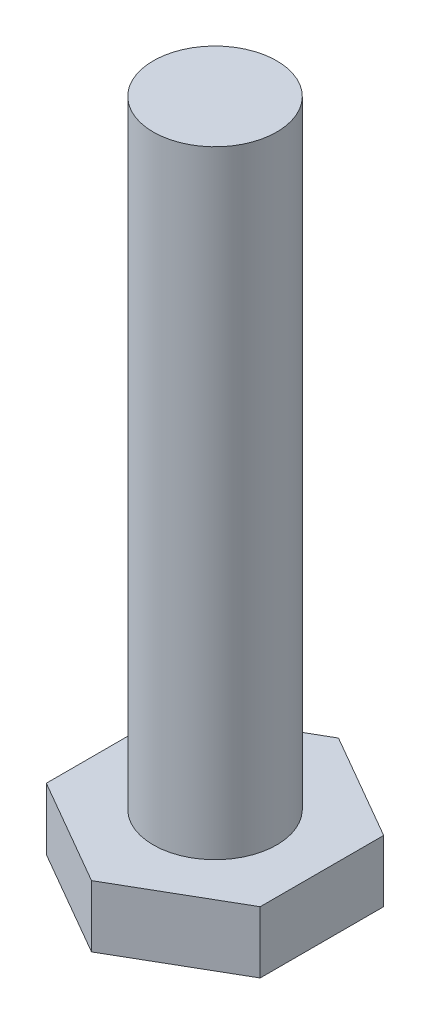
ISO-10303-21;
HEADER;
FILE_DESCRIPTION(('STEP AP214'),'2;1');
FILE_NAME('part.step','',(''),(''),'','','');
FILE_SCHEMA(('AUTOMOTIVE_DESIGN { 1 0 10303 214 1 1 1 1 }'));
ENDSEC;
DATA;
#1=APPLICATION_CONTEXT('core data for automotive mechanical design processes');
#2=APPLICATION_PROTOCOL_DEFINITION('international standard','automotive_design',2000,#1);
#3=PRODUCT_CONTEXT('',#1,'mechanical');
#4=PRODUCT('Part','Part','',(#3));
#5=PRODUCT_RELATED_PRODUCT_CATEGORY('part','',(#4));
#6=PRODUCT_DEFINITION_FORMATION('','',#4);
#7=PRODUCT_DEFINITION_CONTEXT('part definition',#1,'design');
#8=PRODUCT_DEFINITION('design','',#6,#7);
#9=PRODUCT_DEFINITION_SHAPE('','',#8);
#10=(LENGTH_UNIT() NAMED_UNIT(*) SI_UNIT(.MILLI.,.METRE.));
#11=(NAMED_UNIT(*) PLANE_ANGLE_UNIT() SI_UNIT($,.RADIAN.));
#12=(NAMED_UNIT(*) SI_UNIT($,.STERADIAN.) SOLID_ANGLE_UNIT());
#13=UNCERTAINTY_MEASURE_WITH_UNIT(LENGTH_MEASURE(1.E-05),#10,'distance_accuracy_value','');
#14=(GEOMETRIC_REPRESENTATION_CONTEXT(3) GLOBAL_UNCERTAINTY_ASSIGNED_CONTEXT((#13)) GLOBAL_UNIT_ASSIGNED_CONTEXT((#10,
#11,#12)) REPRESENTATION_CONTEXT('',''));
#15=CARTESIAN_POINT('',(0.,0.,0.));
#16=DIRECTION('',(0.,0.,1.));
#17=DIRECTION('',(1.,0.,0.));
#18=AXIS2_PLACEMENT_3D('',#15,#16,#17);
#19=CARTESIAN_POINT('',(0.,0.5,0.));
#20=DIRECTION('',(0.,1.,0.));
#21=DIRECTION('',(0.,0.,1.));
#22=AXIS2_PLACEMENT_3D('',#19,#20,#21);
#23=PLANE('',#22);
#24=DIRECTION('',(-0.866025403784439,0.,0.5));
#25=VECTOR('',#24,1.);
#26=CARTESIAN_POINT('',(-0.433012701892219,0.5,-0.75));
#27=LINE('',#26,#25);
#28=CARTESIAN_POINT('',(0.,0.5,-1.));
#29=VERTEX_POINT('',#28);
#30=CARTESIAN_POINT('',(-0.866025403784438,0.5,-0.5));
#31=VERTEX_POINT('',#30);
#32=EDGE_CURVE('E113',#29,#31,#27,.T.);
#33=ORIENTED_EDGE('',*,*,#32,.T.);
#34=DIRECTION('',(0.,0.,1.));
#35=VECTOR('',#34,1.);
#36=CARTESIAN_POINT('',(-0.866025403784439,0.5,0.));
#37=LINE('',#36,#35);
#38=CARTESIAN_POINT('',(-0.866025403784439,0.5,0.500000000000001));
#39=VERTEX_POINT('',#38);
#40=EDGE_CURVE('E95',#31,#39,#37,.T.);
#41=ORIENTED_EDGE('',*,*,#40,.T.);
#42=DIRECTION('',(0.866025403784439,0.,0.5));
#43=VECTOR('',#42,1.);
#44=CARTESIAN_POINT('',(-0.43301270189222,0.5,0.750000000000001));
#45=LINE('',#44,#43);
#46=CARTESIAN_POINT('',(0.,0.5,1.));
#47=VERTEX_POINT('',#46);
#48=EDGE_CURVE('E134',#39,#47,#45,.T.);
#49=ORIENTED_EDGE('',*,*,#48,.T.);
#50=DIRECTION('',(0.866025403784439,0.,-0.5));
#51=VECTOR('',#50,1.);
#52=CARTESIAN_POINT('',(0.43301270189222,0.5,0.750000000000001));
#53=LINE('',#52,#51);
#54=CARTESIAN_POINT('',(0.866025403784439,0.5,0.500000000000001));
#55=VERTEX_POINT('',#54);
#56=EDGE_CURVE('E131',#47,#55,#53,.T.);
#57=ORIENTED_EDGE('',*,*,#56,.T.);
#58=DIRECTION('',(0.,0.,-1.));
#59=VECTOR('',#58,1.);
#60=CARTESIAN_POINT('',(0.866025403784439,0.5,0.));
#61=LINE('',#60,#59);
#62=CARTESIAN_POINT('',(0.866025403784439,0.5,-0.5));
#63=VERTEX_POINT('',#62);
#64=EDGE_CURVE('E128',#55,#63,#61,.T.);
#65=ORIENTED_EDGE('',*,*,#64,.T.);
#66=DIRECTION('',(-0.866025403784439,0.,-0.5));
#67=VECTOR('',#66,1.);
#68=CARTESIAN_POINT('',(0.433012701892219,0.5,-0.75));
#69=LINE('',#68,#67);
#70=EDGE_CURVE('E125',#63,#29,#69,.T.);
#71=ORIENTED_EDGE('',*,*,#70,.T.);
#72=EDGE_LOOP('',(#33,#41,#49,#57,#65,#71));
#73=FACE_BOUND('',#72,.T.);
#74=CARTESIAN_POINT('',(0.,0.5,0.));
#75=DIRECTION('',(0.,1.,0.));
#76=DIRECTION('',(0.,0.,1.));
#77=AXIS2_PLACEMENT_3D('',#74,#75,#76);
#78=CIRCLE('',#77,0.5);
#79=CARTESIAN_POINT('',(0.,0.5,0.5));
#80=VERTEX_POINT('',#79);
#81=EDGE_CURVE('E39',#80,#80,#78,.T.);
#82=ORIENTED_EDGE('',*,*,#81,.F.);
#83=EDGE_LOOP('',(#82));
#84=FACE_BOUND('',#83,.T.);
#85=ADVANCED_FACE('F35',(#73,#84),#23,.T.);
#86=CARTESIAN_POINT('',(0.,5.5,0.));
#87=DIRECTION('',(0.,-1.,0.));
#88=DIRECTION('',(0.,0.,-1.));
#89=AXIS2_PLACEMENT_3D('',#86,#87,#88);
#90=CYLINDRICAL_SURFACE('',#89,0.5);
#91=CARTESIAN_POINT('',(0.,5.5,0.));
#92=DIRECTION('',(0.,1.,0.));
#93=DIRECTION('',(0.,0.,1.));
#94=AXIS2_PLACEMENT_3D('',#91,#92,#93);
#95=CIRCLE('',#94,0.5);
#96=CARTESIAN_POINT('',(0.,5.5,0.5));
#97=VERTEX_POINT('',#96);
#98=EDGE_CURVE('E11',#97,#97,#95,.T.);
#99=ORIENTED_EDGE('',*,*,#98,.F.);
#100=EDGE_LOOP('',(#99));
#101=FACE_BOUND('',#100,.T.);
#102=ORIENTED_EDGE('',*,*,#81,.T.);
#103=EDGE_LOOP('',(#102));
#104=FACE_BOUND('',#103,.T.);
#105=ADVANCED_FACE('F141',(#101,#104),#90,.T.);
#106=CARTESIAN_POINT('',(0.,5.5,0.));
#107=DIRECTION('',(0.,1.,0.));
#108=DIRECTION('',(0.,0.,1.));
#109=AXIS2_PLACEMENT_3D('',#106,#107,#108);
#110=PLANE('',#109);
#111=ORIENTED_EDGE('',*,*,#98,.T.);
#112=EDGE_LOOP('',(#111));
#113=FACE_BOUND('',#112,.T.);
#114=ADVANCED_FACE('F149',(#113),#110,.T.);
#115=CARTESIAN_POINT('',(-0.866025403784439,10.,0.));
#116=DIRECTION('',(-1.,0.,0.));
#117=DIRECTION('',(0.,0.,1.));
#118=AXIS2_PLACEMENT_3D('',#115,#116,#117);
#119=PLANE('',#118);
#120=ORIENTED_EDGE('',*,*,#40,.F.);
#121=DIRECTION('',(0.,-1.,0.));
#122=VECTOR('',#121,1.);
#123=CARTESIAN_POINT('',(-0.866025403784439,10.,-0.5));
#124=LINE('',#123,#122);
#125=CARTESIAN_POINT('',(-0.866025403784439,0.,-0.5));
#126=VERTEX_POINT('',#125);
#127=EDGE_CURVE('E50',#31,#126,#124,.T.);
#128=ORIENTED_EDGE('',*,*,#127,.T.);
#129=DIRECTION('',(0.,0.,-1.));
#130=VECTOR('',#129,1.);
#131=CARTESIAN_POINT('',(-0.866025403784439,0.,0.));
#132=LINE('',#131,#130);
#133=CARTESIAN_POINT('',(-0.866025403784438,0.,0.500000000000001));
#134=VERTEX_POINT('',#133);
#135=EDGE_CURVE('E87',#134,#126,#132,.T.);
#136=ORIENTED_EDGE('',*,*,#135,.F.);
#137=DIRECTION('',(0.,-1.,0.));
#138=VECTOR('',#137,1.);
#139=CARTESIAN_POINT('',(-0.866025403784439,10.,0.500000000000001));
#140=LINE('',#139,#138);
#141=EDGE_CURVE('E111',#39,#134,#140,.T.);
#142=ORIENTED_EDGE('',*,*,#141,.F.);
#143=EDGE_LOOP('',(#120,#128,#136,#142));
#144=FACE_BOUND('',#143,.T.);
#145=ADVANCED_FACE('F93',(#144),#119,.T.);
#146=CARTESIAN_POINT('',(-0.43301270189222,10.,0.750000000000001));
#147=DIRECTION('',(-0.5,0.,0.866025403784439));
#148=DIRECTION('',(0.866025403784439,0.,0.5));
#149=AXIS2_PLACEMENT_3D('',#146,#147,#148);
#150=PLANE('',#149);
#151=ORIENTED_EDGE('',*,*,#48,.F.);
#152=ORIENTED_EDGE('',*,*,#141,.T.);
#153=DIRECTION('',(-0.866025403784439,0.,-0.5));
#154=VECTOR('',#153,1.);
#155=CARTESIAN_POINT('',(-0.43301270189222,0.,0.750000000000001));
#156=LINE('',#155,#154);
#157=CARTESIAN_POINT('',(0.,0.,1.));
#158=VERTEX_POINT('',#157);
#159=EDGE_CURVE('E58',#158,#134,#156,.T.);
#160=ORIENTED_EDGE('',*,*,#159,.F.);
#161=DIRECTION('',(0.,-1.,0.));
#162=VECTOR('',#161,1.);
#163=CARTESIAN_POINT('',(0.,10.,1.));
#164=LINE('',#163,#162);
#165=EDGE_CURVE('E114',#47,#158,#164,.T.);
#166=ORIENTED_EDGE('',*,*,#165,.F.);
#167=EDGE_LOOP('',(#151,#152,#160,#166));
#168=FACE_BOUND('',#167,.T.);
#169=ADVANCED_FACE('F158',(#168),#150,.T.);
#170=CARTESIAN_POINT('',(0.43301270189222,10.,0.750000000000001));
#171=DIRECTION('',(0.5,0.,0.866025403784439));
#172=DIRECTION('',(0.866025403784439,0.,-0.5));
#173=AXIS2_PLACEMENT_3D('',#170,#171,#172);
#174=PLANE('',#173);
#175=ORIENTED_EDGE('',*,*,#56,.F.);
#176=ORIENTED_EDGE('',*,*,#165,.T.);
#177=DIRECTION('',(-0.866025403784439,0.,0.5));
#178=VECTOR('',#177,1.);
#179=CARTESIAN_POINT('',(0.43301270189222,0.,0.750000000000001));
#180=LINE('',#179,#178);
#181=CARTESIAN_POINT('',(0.866025403784439,0.,0.499999999999999));
#182=VERTEX_POINT('',#181);
#183=EDGE_CURVE('E108',#182,#158,#180,.T.);
#184=ORIENTED_EDGE('',*,*,#183,.F.);
#185=DIRECTION('',(0.,-1.,0.));
#186=VECTOR('',#185,1.);
#187=CARTESIAN_POINT('',(0.866025403784439,10.,0.500000000000001));
#188=LINE('',#187,#186);
#189=EDGE_CURVE('E117',#55,#182,#188,.T.);
#190=ORIENTED_EDGE('',*,*,#189,.F.);
#191=EDGE_LOOP('',(#175,#176,#184,#190));
#192=FACE_BOUND('',#191,.T.);
#193=ADVANCED_FACE('F168',(#192),#174,.T.);
#194=CARTESIAN_POINT('',(0.866025403784439,10.,0.));
#195=DIRECTION('',(1.,0.,0.));
#196=DIRECTION('',(0.,0.,-1.));
#197=AXIS2_PLACEMENT_3D('',#194,#195,#196);
#198=PLANE('',#197);
#199=ORIENTED_EDGE('',*,*,#64,.F.);
#200=ORIENTED_EDGE('',*,*,#189,.T.);
#201=DIRECTION('',(0.,0.,1.));
#202=VECTOR('',#201,1.);
#203=CARTESIAN_POINT('',(0.866025403784439,0.,0.));
#204=LINE('',#203,#202);
#205=CARTESIAN_POINT('',(0.866025403784439,0.,-0.5));
#206=VERTEX_POINT('',#205);
#207=EDGE_CURVE('E104',#206,#182,#204,.T.);
#208=ORIENTED_EDGE('',*,*,#207,.F.);
#209=DIRECTION('',(0.,-1.,0.));
#210=VECTOR('',#209,1.);
#211=CARTESIAN_POINT('',(0.866025403784439,10.,-0.5));
#212=LINE('',#211,#210);
#213=EDGE_CURVE('E120',#63,#206,#212,.T.);
#214=ORIENTED_EDGE('',*,*,#213,.F.);
#215=EDGE_LOOP('',(#199,#200,#208,#214));
#216=FACE_BOUND('',#215,.T.);
#217=ADVANCED_FACE('F164',(#216),#198,.T.);
#218=CARTESIAN_POINT('',(0.433012701892219,10.,-0.75));
#219=DIRECTION('',(0.5,0.,-0.866025403784439));
#220=DIRECTION('',(-0.866025403784439,0.,-0.5));
#221=AXIS2_PLACEMENT_3D('',#218,#219,#220);
#222=PLANE('',#221);
#223=ORIENTED_EDGE('',*,*,#70,.F.);
#224=ORIENTED_EDGE('',*,*,#213,.T.);
#225=DIRECTION('',(0.866025403784439,0.,0.5));
#226=VECTOR('',#225,1.);
#227=CARTESIAN_POINT('',(0.433012701892219,0.,-0.75));
#228=LINE('',#227,#226);
#229=CARTESIAN_POINT('',(0.,0.,-1.));
#230=VERTEX_POINT('',#229);
#231=EDGE_CURVE('E102',#230,#206,#228,.T.);
#232=ORIENTED_EDGE('',*,*,#231,.F.);
#233=DIRECTION('',(0.,-1.,0.));
#234=VECTOR('',#233,1.);
#235=CARTESIAN_POINT('',(0.,10.,-1.));
#236=LINE('',#235,#234);
#237=EDGE_CURVE('E97',#29,#230,#236,.T.);
#238=ORIENTED_EDGE('',*,*,#237,.F.);
#239=EDGE_LOOP('',(#223,#224,#232,#238));
#240=FACE_BOUND('',#239,.T.);
#241=ADVANCED_FACE('F161',(#240),#222,.T.);
#242=CARTESIAN_POINT('',(-0.433012701892219,10.,-0.75));
#243=DIRECTION('',(-0.5,0.,-0.866025403784439));
#244=DIRECTION('',(-0.866025403784439,0.,0.5));
#245=AXIS2_PLACEMENT_3D('',#242,#243,#244);
#246=PLANE('',#245);
#247=ORIENTED_EDGE('',*,*,#32,.F.);
#248=ORIENTED_EDGE('',*,*,#237,.T.);
#249=DIRECTION('',(0.866025403784439,0.,-0.5));
#250=VECTOR('',#249,1.);
#251=CARTESIAN_POINT('',(-0.433012701892219,0.,-0.75));
#252=LINE('',#251,#250);
#253=EDGE_CURVE('E88',#126,#230,#252,.T.);
#254=ORIENTED_EDGE('',*,*,#253,.F.);
#255=ORIENTED_EDGE('',*,*,#127,.F.);
#256=EDGE_LOOP('',(#247,#248,#254,#255));
#257=FACE_BOUND('',#256,.T.);
#258=ADVANCED_FACE('F99',(#257),#246,.T.);
#259=CARTESIAN_POINT('',(0.,0.,0.));
#260=DIRECTION('',(0.,1.,0.));
#261=DIRECTION('',(0.,0.,1.));
#262=AXIS2_PLACEMENT_3D('',#259,#260,#261);
#263=PLANE('',#262);
#264=ORIENTED_EDGE('',*,*,#135,.T.);
#265=ORIENTED_EDGE('',*,*,#253,.T.);
#266=ORIENTED_EDGE('',*,*,#231,.T.);
#267=ORIENTED_EDGE('',*,*,#207,.T.);
#268=ORIENTED_EDGE('',*,*,#183,.T.);
#269=ORIENTED_EDGE('',*,*,#159,.T.);
#270=EDGE_LOOP('',(#264,#265,#266,#267,#268,#269));
#271=FACE_BOUND('',#270,.T.);
#272=ADVANCED_FACE('F37',(#271),#263,.F.);
#273=CLOSED_SHELL('',(#85,#105,#114,#145,#169,#193,#217,#241,#258,#272));
#274=MANIFOLD_SOLID_BREP('B2',#273);
#275=ADVANCED_BREP_SHAPE_REPRESENTATION('',(#18,#274),#14);
#276=SHAPE_DEFINITION_REPRESENTATION(#9,#275);
ENDSEC;
END-ISO-10303-21;
